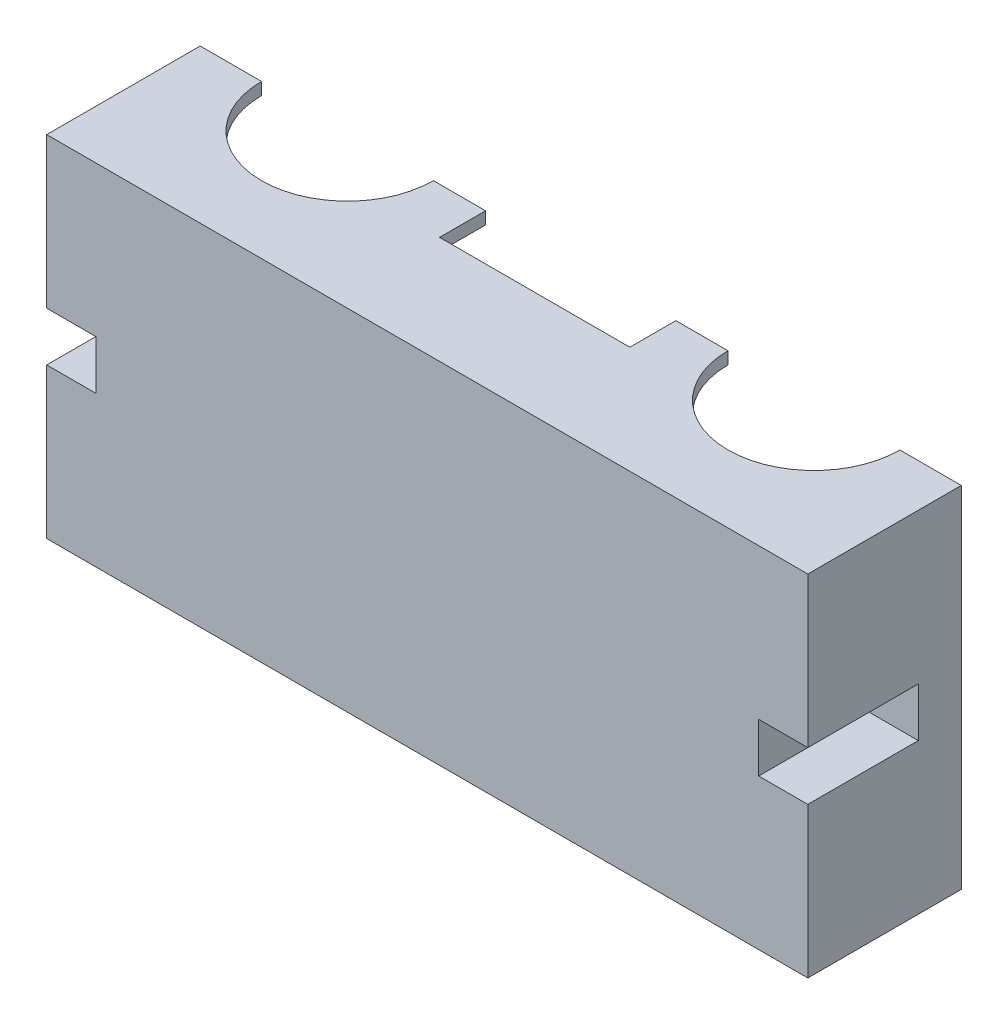
ISO-10303-21;
HEADER;
FILE_DESCRIPTION(('STEP AP214'),'2;1');
FILE_NAME('part.step','',(''),(''),'','','');
FILE_SCHEMA(('AUTOMOTIVE_DESIGN { 1 0 10303 214 1 1 1 1 }'));
ENDSEC;
DATA;
#1=APPLICATION_CONTEXT('core data for automotive mechanical design processes');
#2=APPLICATION_PROTOCOL_DEFINITION('international standard','automotive_design',2000,#1);
#3=PRODUCT_CONTEXT('',#1,'mechanical');
#4=PRODUCT('Part','Part','',(#3));
#5=PRODUCT_RELATED_PRODUCT_CATEGORY('part','',(#4));
#6=PRODUCT_DEFINITION_FORMATION('','',#4);
#7=PRODUCT_DEFINITION_CONTEXT('part definition',#1,'design');
#8=PRODUCT_DEFINITION('design','',#6,#7);
#9=PRODUCT_DEFINITION_SHAPE('','',#8);
#10=(LENGTH_UNIT() NAMED_UNIT(*) SI_UNIT(.MILLI.,.METRE.));
#11=(NAMED_UNIT(*) PLANE_ANGLE_UNIT() SI_UNIT($,.RADIAN.));
#12=(NAMED_UNIT(*) SI_UNIT($,.STERADIAN.) SOLID_ANGLE_UNIT());
#13=UNCERTAINTY_MEASURE_WITH_UNIT(LENGTH_MEASURE(1.E-05),#10,'distance_accuracy_value','');
#14=(GEOMETRIC_REPRESENTATION_CONTEXT(3) GLOBAL_UNCERTAINTY_ASSIGNED_CONTEXT((#13)) GLOBAL_UNIT_ASSIGNED_CONTEXT((#10,
#11,#12)) REPRESENTATION_CONTEXT('',''));
#15=CARTESIAN_POINT('',(0.,0.,0.));
#16=DIRECTION('',(0.,0.,1.));
#17=DIRECTION('',(1.,0.,0.));
#18=AXIS2_PLACEMENT_3D('',#15,#16,#17);
#19=CARTESIAN_POINT('',(0.,0.,0.));
#20=DIRECTION('',(0.,0.,-1.));
#21=DIRECTION('',(-1.,0.,0.));
#22=AXIS2_PLACEMENT_3D('',#19,#20,#21);
#23=PLANE('',#22);
#24=DIRECTION('',(0.,1.,0.));
#25=VECTOR('',#24,1.);
#26=CARTESIAN_POINT('',(-16.9591482885939,27.4147727272727,0.));
#27=LINE('',#26,#25);
#28=CARTESIAN_POINT('',(-16.9591482885939,27.4147727272727,0.));
#29=VERTEX_POINT('',#28);
#30=CARTESIAN_POINT('',(-16.9591482885939,29.4147727272727,0.));
#31=VERTEX_POINT('',#30);
#32=EDGE_CURVE('E262',#29,#31,#27,.T.);
#33=ORIENTED_EDGE('',*,*,#32,.F.);
#34=DIRECTION('',(-1.,0.,0.));
#35=VECTOR('',#34,1.);
#36=CARTESIAN_POINT('',(0.,27.4147727272727,0.));
#37=LINE('',#36,#35);
#38=CARTESIAN_POINT('',(-25.4591482885939,27.4147727272727,0.));
#39=VERTEX_POINT('',#38);
#40=EDGE_CURVE('E256',#29,#39,#37,.T.);
#41=ORIENTED_EDGE('',*,*,#40,.T.);
#42=DIRECTION('',(0.,1.,0.));
#43=VECTOR('',#42,1.);
#44=CARTESIAN_POINT('',(-25.4591482885939,27.4147727272727,0.));
#45=LINE('',#44,#43);
#46=CARTESIAN_POINT('',(-25.4591482885939,29.4147727272727,0.));
#47=VERTEX_POINT('',#46);
#48=EDGE_CURVE('E240',#39,#47,#45,.T.);
#49=ORIENTED_EDGE('',*,*,#48,.T.);
#50=DIRECTION('',(-1.,0.,0.));
#51=VECTOR('',#50,1.);
#52=CARTESIAN_POINT('',(-102.959148288594,29.4147727272727,0.));
#53=LINE('',#52,#51);
#54=EDGE_CURVE('E406',#31,#47,#53,.T.);
#55=ORIENTED_EDGE('',*,*,#54,.F.);
#56=EDGE_LOOP('',(#33,#41,#49,#55));
#57=FACE_BOUND('',#56,.T.);
#58=ADVANCED_FACE('F32',(#57),#23,.T.);
#59=DIRECTION('',(0.,1.,0.));
#60=VECTOR('',#59,1.);
#61=CARTESIAN_POINT('',(11.0408517114061,27.4147727272727,0.));
#62=LINE('',#61,#60);
#63=CARTESIAN_POINT('',(11.0408517114061,29.4147727272727,0.));
#64=VERTEX_POINT('',#63);
#65=CARTESIAN_POINT('',(11.0408517114061,27.4147727272727,0.));
#66=VERTEX_POINT('',#65);
#67=EDGE_CURVE('E430',#64,#66,#62,.F.);
#68=ORIENTED_EDGE('',*,*,#67,.F.);
#69=CARTESIAN_POINT('',(21.0408517114061,29.4147727272727,0.));
#70=VERTEX_POINT('',#69);
#71=EDGE_CURVE('E403',#70,#64,#53,.T.);
#72=ORIENTED_EDGE('',*,*,#71,.F.);
#73=DIRECTION('',(0.,1.,0.));
#74=VECTOR('',#73,1.);
#75=CARTESIAN_POINT('',(21.0408517114061,-27.5852272727273,0.));
#76=LINE('',#75,#74);
#77=CARTESIAN_POINT('',(21.0408517114061,-27.5852272727273,0.));
#78=VERTEX_POINT('',#77);
#79=EDGE_CURVE('E400',#78,#70,#76,.T.);
#80=ORIENTED_EDGE('',*,*,#79,.F.);
#81=DIRECTION('',(1.,0.,0.));
#82=VECTOR('',#81,1.);
#83=CARTESIAN_POINT('',(-102.959148288594,-27.5852272727273,0.));
#84=LINE('',#83,#82);
#85=CARTESIAN_POINT('',(-102.959148288594,-27.5852272727273,0.));
#86=VERTEX_POINT('',#85);
#87=EDGE_CURVE('E398',#86,#78,#84,.T.);
#88=ORIENTED_EDGE('',*,*,#87,.F.);
#89=DIRECTION('',(0.,-1.,0.));
#90=VECTOR('',#89,1.);
#91=CARTESIAN_POINT('',(-102.959148288594,-27.5852272727273,0.));
#92=LINE('',#91,#90);
#93=CARTESIAN_POINT('',(-102.959148288594,29.4147727272727,0.));
#94=VERTEX_POINT('',#93);
#95=EDGE_CURVE('E351',#94,#86,#92,.T.);
#96=ORIENTED_EDGE('',*,*,#95,.F.);
#97=CARTESIAN_POINT('',(-92.9591482885939,29.4147727272727,0.));
#98=VERTEX_POINT('',#97);
#99=EDGE_CURVE('E402',#98,#94,#53,.T.);
#100=ORIENTED_EDGE('',*,*,#99,.F.);
#101=DIRECTION('',(0.,1.,0.));
#102=VECTOR('',#101,1.);
#103=CARTESIAN_POINT('',(-92.9591482885939,27.4147727272727,0.));
#104=LINE('',#103,#102);
#105=CARTESIAN_POINT('',(-92.9591482885939,27.4147727272727,0.));
#106=VERTEX_POINT('',#105);
#107=EDGE_CURVE('E419',#106,#98,#104,.T.);
#108=ORIENTED_EDGE('',*,*,#107,.F.);
#109=CARTESIAN_POINT('',(-100.959148288594,27.4147727272727,0.));
#110=VERTEX_POINT('',#109);
#111=EDGE_CURVE('E268',#106,#110,#37,.T.);
#112=ORIENTED_EDGE('',*,*,#111,.T.);
#113=DIRECTION('',(0.,-1.,0.));
#114=VECTOR('',#113,1.);
#115=CARTESIAN_POINT('',(-100.959148288594,0.,0.));
#116=LINE('',#115,#114);
#117=CARTESIAN_POINT('',(-100.959148288594,7.41477272727273,0.));
#118=VERTEX_POINT('',#117);
#119=EDGE_CURVE('E272',#110,#118,#116,.T.);
#120=ORIENTED_EDGE('',*,*,#119,.T.);
#121=DIRECTION('',(-1.,0.,0.));
#122=VECTOR('',#121,1.);
#123=CARTESIAN_POINT('',(0.,7.41477272727273,0.));
#124=LINE('',#123,#122);
#125=CARTESIAN_POINT('',(-93.4591482885939,7.41477272727273,0.));
#126=VERTEX_POINT('',#125);
#127=EDGE_CURVE('E280',#126,#118,#124,.T.);
#128=ORIENTED_EDGE('',*,*,#127,.F.);
#129=DIRECTION('',(0.,-1.,0.));
#130=VECTOR('',#129,1.);
#131=CARTESIAN_POINT('',(-93.4591482885939,0.,0.));
#132=LINE('',#131,#130);
#133=CARTESIAN_POINT('',(-93.4591482885939,-5.58522727272727,0.));
#134=VERTEX_POINT('',#133);
#135=EDGE_CURVE('E296',#126,#134,#132,.T.);
#136=ORIENTED_EDGE('',*,*,#135,.T.);
#137=DIRECTION('',(-1.,0.,0.));
#138=VECTOR('',#137,1.);
#139=CARTESIAN_POINT('',(0.,-5.58522727272727,0.));
#140=LINE('',#139,#138);
#141=CARTESIAN_POINT('',(-100.959148288594,-5.58522727272727,0.));
#142=VERTEX_POINT('',#141);
#143=EDGE_CURVE('E287',#134,#142,#140,.T.);
#144=ORIENTED_EDGE('',*,*,#143,.T.);
#145=DIRECTION('',(0.,-1.,0.));
#146=VECTOR('',#145,1.);
#147=CARTESIAN_POINT('',(-100.959148288594,0.,0.));
#148=LINE('',#147,#146);
#149=CARTESIAN_POINT('',(-100.959148288594,-25.5852272727273,0.));
#150=VERTEX_POINT('',#149);
#151=EDGE_CURVE('E293',#142,#150,#148,.T.);
#152=ORIENTED_EDGE('',*,*,#151,.T.);
#153=DIRECTION('',(-1.,0.,0.));
#154=VECTOR('',#153,1.);
#155=CARTESIAN_POINT('',(0.,-25.5852272727273,0.));
#156=LINE('',#155,#154);
#157=CARTESIAN_POINT('',(19.0408517114061,-25.5852272727273,0.));
#158=VERTEX_POINT('',#157);
#159=EDGE_CURVE('E290',#158,#150,#156,.T.);
#160=ORIENTED_EDGE('',*,*,#159,.F.);
#161=DIRECTION('',(0.,-1.,0.));
#162=VECTOR('',#161,1.);
#163=CARTESIAN_POINT('',(19.0408517114061,0.,0.));
#164=LINE('',#163,#162);
#165=CARTESIAN_POINT('',(19.0408517114061,-5.58522727272727,0.));
#166=VERTEX_POINT('',#165);
#167=EDGE_CURVE('E286',#166,#158,#164,.T.);
#168=ORIENTED_EDGE('',*,*,#167,.F.);
#169=CARTESIAN_POINT('',(11.5408517114061,-5.58522727272727,0.));
#170=VERTEX_POINT('',#169);
#171=EDGE_CURVE('E283',#166,#170,#140,.T.);
#172=ORIENTED_EDGE('',*,*,#171,.T.);
#173=DIRECTION('',(0.,-1.,0.));
#174=VECTOR('',#173,1.);
#175=CARTESIAN_POINT('',(11.5408517114061,0.,0.));
#176=LINE('',#175,#174);
#177=CARTESIAN_POINT('',(11.5408517114061,7.41477272727273,0.));
#178=VERTEX_POINT('',#177);
#179=EDGE_CURVE('E279',#178,#170,#176,.T.);
#180=ORIENTED_EDGE('',*,*,#179,.F.);
#181=CARTESIAN_POINT('',(19.0408517114061,7.41477272727273,0.));
#182=VERTEX_POINT('',#181);
#183=EDGE_CURVE('E276',#182,#178,#124,.T.);
#184=ORIENTED_EDGE('',*,*,#183,.F.);
#185=DIRECTION('',(0.,-1.,0.));
#186=VECTOR('',#185,1.);
#187=CARTESIAN_POINT('',(19.0408517114061,0.,0.));
#188=LINE('',#187,#186);
#189=CARTESIAN_POINT('',(19.0408517114061,27.4147727272727,0.));
#190=VERTEX_POINT('',#189);
#191=EDGE_CURVE('E267',#190,#182,#188,.T.);
#192=ORIENTED_EDGE('',*,*,#191,.F.);
#193=EDGE_CURVE('E263',#190,#66,#37,.T.);
#194=ORIENTED_EDGE('',*,*,#193,.T.);
#195=EDGE_LOOP('',(#68,#72,#80,#88,#96,#100,#108,#112,#120,#128,#136,#144,#152,#160,#168,#172,
#180,#184,#192,#194));
#196=FACE_BOUND('',#195,.T.);
#197=ADVANCED_FACE('F426',(#196),#23,.T.);
#198=DIRECTION('',(0.,1.,0.));
#199=VECTOR('',#198,1.);
#200=CARTESIAN_POINT('',(-64.9591482885939,27.4147727272727,0.));
#201=LINE('',#200,#199);
#202=CARTESIAN_POINT('',(-64.9591482885939,29.4147727272727,0.));
#203=VERTEX_POINT('',#202);
#204=CARTESIAN_POINT('',(-64.9591482885939,27.4147727272727,0.));
#205=VERTEX_POINT('',#204);
#206=EDGE_CURVE('E55',#203,#205,#201,.F.);
#207=ORIENTED_EDGE('',*,*,#206,.F.);
#208=CARTESIAN_POINT('',(-56.4591482885939,29.4147727272727,0.));
#209=VERTEX_POINT('',#208);
#210=EDGE_CURVE('E547',#209,#203,#53,.T.);
#211=ORIENTED_EDGE('',*,*,#210,.F.);
#212=DIRECTION('',(0.,1.,0.));
#213=VECTOR('',#212,1.);
#214=CARTESIAN_POINT('',(-56.4591482885939,27.4147727272727,0.));
#215=LINE('',#214,#213);
#216=CARTESIAN_POINT('',(-56.4591482885939,27.4147727272727,0.));
#217=VERTEX_POINT('',#216);
#218=EDGE_CURVE('E250',#217,#209,#215,.T.);
#219=ORIENTED_EDGE('',*,*,#218,.F.);
#220=EDGE_CURVE('E264',#217,#205,#37,.T.);
#221=ORIENTED_EDGE('',*,*,#220,.T.);
#222=EDGE_LOOP('',(#207,#211,#219,#221));
#223=FACE_BOUND('',#222,.T.);
#224=ADVANCED_FACE('F548',(#223),#23,.T.);
#225=CARTESIAN_POINT('',(-102.959148288594,-27.5852272727273,25.));
#226=DIRECTION('',(1.,0.,0.));
#227=DIRECTION('',(0.,0.,-1.));
#228=AXIS2_PLACEMENT_3D('',#225,#226,#227);
#229=PLANE('',#228);
#230=DIRECTION('',(0.,-1.,0.));
#231=VECTOR('',#230,1.);
#232=CARTESIAN_POINT('',(-102.959148288594,-27.5852272727273,25.));
#233=LINE('',#232,#231);
#234=CARTESIAN_POINT('',(-102.959148288594,-3.08522727272727,25.));
#235=VERTEX_POINT('',#234);
#236=CARTESIAN_POINT('',(-102.959148288594,-27.5852272727273,25.));
#237=VERTEX_POINT('',#236);
#238=EDGE_CURVE('E387',#235,#237,#233,.T.);
#239=ORIENTED_EDGE('',*,*,#238,.F.);
#240=DIRECTION('',(0.,0.,1.));
#241=VECTOR('',#240,1.);
#242=CARTESIAN_POINT('',(-102.959148288594,-3.08522727272727,7.));
#243=LINE('',#242,#241);
#244=CARTESIAN_POINT('',(-102.959148288594,-3.08522727272727,7.));
#245=VERTEX_POINT('',#244);
#246=EDGE_CURVE('E376',#245,#235,#243,.T.);
#247=ORIENTED_EDGE('',*,*,#246,.F.);
#248=DIRECTION('',(0.,-1.,0.));
#249=VECTOR('',#248,1.);
#250=CARTESIAN_POINT('',(-102.959148288594,4.91477272727273,7.));
#251=LINE('',#250,#249);
#252=CARTESIAN_POINT('',(-102.959148288594,4.91477272727273,7.));
#253=VERTEX_POINT('',#252);
#254=EDGE_CURVE('E364',#253,#245,#251,.T.);
#255=ORIENTED_EDGE('',*,*,#254,.F.);
#256=DIRECTION('',(0.,0.,1.));
#257=VECTOR('',#256,1.);
#258=CARTESIAN_POINT('',(-102.959148288594,4.91477272727273,7.));
#259=LINE('',#258,#257);
#260=CARTESIAN_POINT('',(-102.959148288594,4.91477272727273,25.));
#261=VERTEX_POINT('',#260);
#262=EDGE_CURVE('E378',#253,#261,#259,.T.);
#263=ORIENTED_EDGE('',*,*,#262,.T.);
#264=CARTESIAN_POINT('',(-102.959148288594,29.4147727272727,25.));
#265=VERTEX_POINT('',#264);
#266=EDGE_CURVE('E383',#265,#261,#233,.T.);
#267=ORIENTED_EDGE('',*,*,#266,.F.);
#268=DIRECTION('',(0.,0.,-1.));
#269=VECTOR('',#268,1.);
#270=CARTESIAN_POINT('',(-102.959148288594,29.4147727272727,25.));
#271=LINE('',#270,#269);
#272=EDGE_CURVE('E395',#265,#94,#271,.T.);
#273=ORIENTED_EDGE('',*,*,#272,.T.);
#274=ORIENTED_EDGE('',*,*,#95,.T.);
#275=DIRECTION('',(0.,0.,-1.));
#276=VECTOR('',#275,1.);
#277=CARTESIAN_POINT('',(-102.959148288594,-27.5852272727273,25.));
#278=LINE('',#277,#276);
#279=EDGE_CURVE('E415',#237,#86,#278,.T.);
#280=ORIENTED_EDGE('',*,*,#279,.F.);
#281=EDGE_LOOP('',(#239,#247,#255,#263,#267,#273,#274,#280));
#282=FACE_BOUND('',#281,.T.);
#283=ADVANCED_FACE('F34',(#282),#229,.F.);
#284=CARTESIAN_POINT('',(-102.959148288594,-27.5852272727273,25.));
#285=DIRECTION('',(0.,1.,0.));
#286=DIRECTION('',(0.,0.,1.));
#287=AXIS2_PLACEMENT_3D('',#284,#285,#286);
#288=PLANE('',#287);
#289=ORIENTED_EDGE('',*,*,#87,.T.);
#290=DIRECTION('',(0.,0.,-1.));
#291=VECTOR('',#290,1.);
#292=CARTESIAN_POINT('',(21.0408517114061,-27.5852272727273,25.));
#293=LINE('',#292,#291);
#294=CARTESIAN_POINT('',(21.0408517114061,-27.5852272727273,25.));
#295=VERTEX_POINT('',#294);
#296=EDGE_CURVE('E412',#295,#78,#293,.T.);
#297=ORIENTED_EDGE('',*,*,#296,.F.);
#298=DIRECTION('',(1.,0.,0.));
#299=VECTOR('',#298,1.);
#300=CARTESIAN_POINT('',(-102.959148288594,-27.5852272727273,25.));
#301=LINE('',#300,#299);
#302=EDGE_CURVE('E386',#237,#295,#301,.T.);
#303=ORIENTED_EDGE('',*,*,#302,.F.);
#304=ORIENTED_EDGE('',*,*,#279,.T.);
#305=EDGE_LOOP('',(#289,#297,#303,#304));
#306=FACE_BOUND('',#305,.T.);
#307=ADVANCED_FACE('F559',(#306),#288,.F.);
#308=CARTESIAN_POINT('',(21.0408517114061,-27.5852272727273,25.));
#309=DIRECTION('',(-1.,0.,0.));
#310=DIRECTION('',(0.,-1.,0.));
#311=AXIS2_PLACEMENT_3D('',#308,#309,#310);
#312=PLANE('',#311);
#313=DIRECTION('',(0.,1.,0.));
#314=VECTOR('',#313,1.);
#315=CARTESIAN_POINT('',(21.0408517114061,4.91477272727273,7.));
#316=LINE('',#315,#314);
#317=CARTESIAN_POINT('',(21.0408517114061,-3.08522727272727,7.));
#318=VERTEX_POINT('',#317);
#319=CARTESIAN_POINT('',(21.0408517114061,4.91477272727273,7.));
#320=VERTEX_POINT('',#319);
#321=EDGE_CURVE('E326',#318,#320,#316,.T.);
#322=ORIENTED_EDGE('',*,*,#321,.F.);
#323=DIRECTION('',(0.,0.,1.));
#324=VECTOR('',#323,1.);
#325=CARTESIAN_POINT('',(21.0408517114061,-3.08522727272727,7.));
#326=LINE('',#325,#324);
#327=CARTESIAN_POINT('',(21.0408517114061,-3.08522727272727,25.));
#328=VERTEX_POINT('',#327);
#329=EDGE_CURVE('E348',#318,#328,#326,.T.);
#330=ORIENTED_EDGE('',*,*,#329,.T.);
#331=DIRECTION('',(0.,1.,0.));
#332=VECTOR('',#331,1.);
#333=CARTESIAN_POINT('',(21.0408517114061,-27.5852272727273,25.));
#334=LINE('',#333,#332);
#335=EDGE_CURVE('E390',#295,#328,#334,.T.);
#336=ORIENTED_EDGE('',*,*,#335,.F.);
#337=ORIENTED_EDGE('',*,*,#296,.T.);
#338=ORIENTED_EDGE('',*,*,#79,.T.);
#339=DIRECTION('',(0.,0.,-1.));
#340=VECTOR('',#339,1.);
#341=CARTESIAN_POINT('',(21.0408517114061,29.4147727272727,25.));
#342=LINE('',#341,#340);
#343=CARTESIAN_POINT('',(21.0408517114061,29.4147727272727,25.));
#344=VERTEX_POINT('',#343);
#345=EDGE_CURVE('E409',#344,#70,#342,.T.);
#346=ORIENTED_EDGE('',*,*,#345,.F.);
#347=CARTESIAN_POINT('',(21.0408517114061,4.91477272727272,25.));
#348=VERTEX_POINT('',#347);
#349=EDGE_CURVE('E389',#348,#344,#334,.T.);
#350=ORIENTED_EDGE('',*,*,#349,.F.);
#351=DIRECTION('',(0.,0.,1.));
#352=VECTOR('',#351,1.);
#353=CARTESIAN_POINT('',(21.0408517114061,4.91477272727273,7.));
#354=LINE('',#353,#352);
#355=EDGE_CURVE('E339',#320,#348,#354,.T.);
#356=ORIENTED_EDGE('',*,*,#355,.F.);
#357=EDGE_LOOP('',(#322,#330,#336,#337,#338,#346,#350,#356));
#358=FACE_BOUND('',#357,.T.);
#359=ADVANCED_FACE('F580',(#358),#312,.F.);
#360=CARTESIAN_POINT('',(-102.959148288594,29.4147727272727,25.));
#361=DIRECTION('',(0.,-1.,0.));
#362=DIRECTION('',(0.,0.,-1.));
#363=AXIS2_PLACEMENT_3D('',#360,#361,#362);
#364=PLANE('',#363);
#365=ORIENTED_EDGE('',*,*,#71,.T.);
#366=CARTESIAN_POINT('',(-2.95914828859391,29.4147727272727,0.));
#367=DIRECTION('',(0.,1.,0.));
#368=DIRECTION('',(0.,0.,1.));
#369=AXIS2_PLACEMENT_3D('',#366,#367,#368);
#370=CIRCLE('',#369,14.);
#371=EDGE_CURVE('E519',#31,#64,#370,.T.);
#372=ORIENTED_EDGE('',*,*,#371,.F.);
#373=ORIENTED_EDGE('',*,*,#54,.T.);
#374=DIRECTION('',(0.,0.,-1.));
#375=VECTOR('',#374,1.);
#376=CARTESIAN_POINT('',(-25.4591482885939,29.4147727272727,0.));
#377=LINE('',#376,#375);
#378=CARTESIAN_POINT('',(-25.4591482885939,29.4147727272727,7.5));
#379=VERTEX_POINT('',#378);
#380=EDGE_CURVE('E245',#379,#47,#377,.T.);
#381=ORIENTED_EDGE('',*,*,#380,.F.);
#382=DIRECTION('',(1.,0.,0.));
#383=VECTOR('',#382,1.);
#384=CARTESIAN_POINT('',(-25.4591482885939,29.4147727272727,7.5));
#385=LINE('',#384,#383);
#386=CARTESIAN_POINT('',(-56.4591482885939,29.4147727272727,7.5));
#387=VERTEX_POINT('',#386);
#388=EDGE_CURVE('E259',#387,#379,#385,.T.);
#389=ORIENTED_EDGE('',*,*,#388,.F.);
#390=DIRECTION('',(0.,0.,1.));
#391=VECTOR('',#390,1.);
#392=CARTESIAN_POINT('',(-56.4591482885939,29.4147727272727,0.));
#393=LINE('',#392,#391);
#394=EDGE_CURVE('E530',#209,#387,#393,.T.);
#395=ORIENTED_EDGE('',*,*,#394,.F.);
#396=ORIENTED_EDGE('',*,*,#210,.T.);
#397=CARTESIAN_POINT('',(-78.9591482885939,29.4147727272727,0.));
#398=DIRECTION('',(0.,1.,0.));
#399=DIRECTION('',(0.,0.,1.));
#400=AXIS2_PLACEMENT_3D('',#397,#398,#399);
#401=CIRCLE('',#400,14.);
#402=EDGE_CURVE('E521',#98,#203,#401,.T.);
#403=ORIENTED_EDGE('',*,*,#402,.F.);
#404=ORIENTED_EDGE('',*,*,#99,.T.);
#405=ORIENTED_EDGE('',*,*,#272,.F.);
#406=DIRECTION('',(-1.,0.,0.));
#407=VECTOR('',#406,1.);
#408=CARTESIAN_POINT('',(-102.959148288594,29.4147727272727,25.));
#409=LINE('',#408,#407);
#410=EDGE_CURVE('E393',#344,#265,#409,.T.);
#411=ORIENTED_EDGE('',*,*,#410,.F.);
#412=ORIENTED_EDGE('',*,*,#345,.T.);
#413=EDGE_LOOP('',(#365,#372,#373,#381,#389,#395,#396,#403,#404,#405,#411,#412));
#414=FACE_BOUND('',#413,.T.);
#415=ADVANCED_FACE('F546',(#414),#364,.F.);
#416=CARTESIAN_POINT('',(0.,0.,25.));
#417=DIRECTION('',(0.,0.,-1.));
#418=DIRECTION('',(-1.,0.,0.));
#419=AXIS2_PLACEMENT_3D('',#416,#417,#418);
#420=PLANE('',#419);
#421=ORIENTED_EDGE('',*,*,#335,.T.);
#422=DIRECTION('',(1.,0.,0.));
#423=VECTOR('',#422,1.);
#424=CARTESIAN_POINT('',(21.0408517114061,-3.08522727272727,25.));
#425=LINE('',#424,#423);
#426=CARTESIAN_POINT('',(13.0408517114061,-3.08522727272727,25.));
#427=VERTEX_POINT('',#426);
#428=EDGE_CURVE('E330',#427,#328,#425,.T.);
#429=ORIENTED_EDGE('',*,*,#428,.F.);
#430=DIRECTION('',(0.,-1.,0.));
#431=VECTOR('',#430,1.);
#432=CARTESIAN_POINT('',(13.0408517114061,4.91477272727273,25.));
#433=LINE('',#432,#431);
#434=CARTESIAN_POINT('',(13.0408517114061,4.91477272727273,25.));
#435=VERTEX_POINT('',#434);
#436=EDGE_CURVE('E343',#435,#427,#433,.T.);
#437=ORIENTED_EDGE('',*,*,#436,.F.);
#438=DIRECTION('',(-1.,0.,0.));
#439=VECTOR('',#438,1.);
#440=CARTESIAN_POINT('',(21.0408517114061,4.91477272727273,25.));
#441=LINE('',#440,#439);
#442=EDGE_CURVE('E340',#348,#435,#441,.T.);
#443=ORIENTED_EDGE('',*,*,#442,.F.);
#444=ORIENTED_EDGE('',*,*,#349,.T.);
#445=ORIENTED_EDGE('',*,*,#410,.T.);
#446=ORIENTED_EDGE('',*,*,#266,.T.);
#447=DIRECTION('',(-1.,0.,0.));
#448=VECTOR('',#447,1.);
#449=CARTESIAN_POINT('',(-94.9591482885939,4.91477272727273,25.));
#450=LINE('',#449,#448);
#451=CARTESIAN_POINT('',(-94.9591482885939,4.91477272727273,25.));
#452=VERTEX_POINT('',#451);
#453=EDGE_CURVE('E371',#452,#261,#450,.T.);
#454=ORIENTED_EDGE('',*,*,#453,.F.);
#455=DIRECTION('',(0.,1.,0.));
#456=VECTOR('',#455,1.);
#457=CARTESIAN_POINT('',(-94.9591482885939,4.91477272727273,25.));
#458=LINE('',#457,#456);
#459=CARTESIAN_POINT('',(-94.9591482885939,-3.08522727272727,25.));
#460=VERTEX_POINT('',#459);
#461=EDGE_CURVE('E301',#460,#452,#458,.T.);
#462=ORIENTED_EDGE('',*,*,#461,.F.);
#463=DIRECTION('',(1.,0.,0.));
#464=VECTOR('',#463,1.);
#465=CARTESIAN_POINT('',(-94.9591482885939,-3.08522727272727,25.));
#466=LINE('',#465,#464);
#467=EDGE_CURVE('E361',#235,#460,#466,.T.);
#468=ORIENTED_EDGE('',*,*,#467,.F.);
#469=ORIENTED_EDGE('',*,*,#238,.T.);
#470=ORIENTED_EDGE('',*,*,#302,.T.);
#471=EDGE_LOOP('',(#421,#429,#437,#443,#444,#445,#446,#454,#462,#468,#469,#470));
#472=FACE_BOUND('',#471,.T.);
#473=ADVANCED_FACE('F564',(#472),#420,.F.);
#474=CARTESIAN_POINT('',(-94.9591482885939,4.91477272727273,7.));
#475=DIRECTION('',(1.,0.,0.));
#476=DIRECTION('',(0.,0.,-1.));
#477=AXIS2_PLACEMENT_3D('',#474,#475,#476);
#478=PLANE('',#477);
#479=ORIENTED_EDGE('',*,*,#461,.T.);
#480=DIRECTION('',(0.,0.,1.));
#481=VECTOR('',#480,1.);
#482=CARTESIAN_POINT('',(-94.9591482885939,4.91477272727273,7.));
#483=LINE('',#482,#481);
#484=CARTESIAN_POINT('',(-94.9591482885939,4.91477272727273,7.));
#485=VERTEX_POINT('',#484);
#486=EDGE_CURVE('E369',#485,#452,#483,.T.);
#487=ORIENTED_EDGE('',*,*,#486,.F.);
#488=DIRECTION('',(0.,1.,0.));
#489=VECTOR('',#488,1.);
#490=CARTESIAN_POINT('',(-94.9591482885939,4.91477272727273,7.));
#491=LINE('',#490,#489);
#492=CARTESIAN_POINT('',(-94.9591482885939,-3.08522727272727,7.));
#493=VERTEX_POINT('',#492);
#494=EDGE_CURVE('E357',#493,#485,#491,.T.);
#495=ORIENTED_EDGE('',*,*,#494,.F.);
#496=DIRECTION('',(0.,0.,1.));
#497=VECTOR('',#496,1.);
#498=CARTESIAN_POINT('',(-94.9591482885939,-3.08522727272727,7.));
#499=LINE('',#498,#497);
#500=EDGE_CURVE('E344',#493,#460,#499,.T.);
#501=ORIENTED_EDGE('',*,*,#500,.T.);
#502=EDGE_LOOP('',(#479,#487,#495,#501));
#503=FACE_BOUND('',#502,.T.);
#504=ADVANCED_FACE('F626',(#503),#478,.F.);
#505=CARTESIAN_POINT('',(-94.9591482885939,-3.08522727272727,7.));
#506=DIRECTION('',(0.,-1.,0.));
#507=DIRECTION('',(1.,0.,0.));
#508=AXIS2_PLACEMENT_3D('',#505,#506,#507);
#509=PLANE('',#508);
#510=ORIENTED_EDGE('',*,*,#467,.T.);
#511=ORIENTED_EDGE('',*,*,#500,.F.);
#512=DIRECTION('',(1.,0.,0.));
#513=VECTOR('',#512,1.);
#514=CARTESIAN_POINT('',(-94.9591482885939,-3.08522727272727,7.));
#515=LINE('',#514,#513);
#516=EDGE_CURVE('E366',#245,#493,#515,.T.);
#517=ORIENTED_EDGE('',*,*,#516,.F.);
#518=ORIENTED_EDGE('',*,*,#246,.T.);
#519=EDGE_LOOP('',(#510,#511,#517,#518));
#520=FACE_BOUND('',#519,.T.);
#521=ADVANCED_FACE('F568',(#520),#509,.F.);
#522=CARTESIAN_POINT('',(-94.9591482885939,4.91477272727273,7.));
#523=DIRECTION('',(0.,1.,0.));
#524=DIRECTION('',(-1.,0.,0.));
#525=AXIS2_PLACEMENT_3D('',#522,#523,#524);
#526=PLANE('',#525);
#527=ORIENTED_EDGE('',*,*,#453,.T.);
#528=ORIENTED_EDGE('',*,*,#262,.F.);
#529=DIRECTION('',(-1.,0.,0.));
#530=VECTOR('',#529,1.);
#531=CARTESIAN_POINT('',(-94.9591482885939,4.91477272727273,7.));
#532=LINE('',#531,#530);
#533=EDGE_CURVE('E360',#485,#253,#532,.T.);
#534=ORIENTED_EDGE('',*,*,#533,.F.);
#535=ORIENTED_EDGE('',*,*,#486,.T.);
#536=EDGE_LOOP('',(#527,#528,#534,#535));
#537=FACE_BOUND('',#536,.T.);
#538=ADVANCED_FACE('F633',(#537),#526,.F.);
#539=CARTESIAN_POINT('',(0.,0.,7.));
#540=DIRECTION('',(0.,0.,-1.));
#541=DIRECTION('',(-1.,0.,0.));
#542=AXIS2_PLACEMENT_3D('',#539,#540,#541);
#543=PLANE('',#542);
#544=ORIENTED_EDGE('',*,*,#494,.T.);
#545=ORIENTED_EDGE('',*,*,#533,.T.);
#546=ORIENTED_EDGE('',*,*,#254,.T.);
#547=ORIENTED_EDGE('',*,*,#516,.T.);
#548=EDGE_LOOP('',(#544,#545,#546,#547));
#549=FACE_BOUND('',#548,.T.);
#550=ADVANCED_FACE('F572',(#549),#543,.F.);
#551=CARTESIAN_POINT('',(21.0408517114061,-3.08522727272727,7.));
#552=DIRECTION('',(0.,-1.,0.));
#553=DIRECTION('',(1.,0.,0.));
#554=AXIS2_PLACEMENT_3D('',#551,#552,#553);
#555=PLANE('',#554);
#556=ORIENTED_EDGE('',*,*,#428,.T.);
#557=ORIENTED_EDGE('',*,*,#329,.F.);
#558=DIRECTION('',(1.,0.,0.));
#559=VECTOR('',#558,1.);
#560=CARTESIAN_POINT('',(21.0408517114061,-3.08522727272727,7.));
#561=LINE('',#560,#559);
#562=CARTESIAN_POINT('',(13.0408517114061,-3.08522727272727,7.));
#563=VERTEX_POINT('',#562);
#564=EDGE_CURVE('E336',#563,#318,#561,.T.);
#565=ORIENTED_EDGE('',*,*,#564,.F.);
#566=DIRECTION('',(0.,0.,1.));
#567=VECTOR('',#566,1.);
#568=CARTESIAN_POINT('',(13.0408517114061,-3.08522727272727,7.));
#569=LINE('',#568,#567);
#570=EDGE_CURVE('E352',#563,#427,#569,.T.);
#571=ORIENTED_EDGE('',*,*,#570,.T.);
#572=EDGE_LOOP('',(#556,#557,#565,#571));
#573=FACE_BOUND('',#572,.T.);
#574=ADVANCED_FACE('F586',(#573),#555,.F.);
#575=CARTESIAN_POINT('',(13.0408517114061,4.91477272727273,7.));
#576=DIRECTION('',(-1.,0.,0.));
#577=DIRECTION('',(0.,-1.,0.));
#578=AXIS2_PLACEMENT_3D('',#575,#576,#577);
#579=PLANE('',#578);
#580=ORIENTED_EDGE('',*,*,#436,.T.);
#581=ORIENTED_EDGE('',*,*,#570,.F.);
#582=DIRECTION('',(0.,-1.,0.));
#583=VECTOR('',#582,1.);
#584=CARTESIAN_POINT('',(13.0408517114061,4.91477272727273,7.));
#585=LINE('',#584,#583);
#586=CARTESIAN_POINT('',(13.0408517114061,4.91477272727273,7.));
#587=VERTEX_POINT('',#586);
#588=EDGE_CURVE('E333',#587,#563,#585,.T.);
#589=ORIENTED_EDGE('',*,*,#588,.F.);
#590=DIRECTION('',(0.,0.,1.));
#591=VECTOR('',#590,1.);
#592=CARTESIAN_POINT('',(13.0408517114061,4.91477272727273,7.));
#593=LINE('',#592,#591);
#594=EDGE_CURVE('E354',#587,#435,#593,.T.);
#595=ORIENTED_EDGE('',*,*,#594,.T.);
#596=EDGE_LOOP('',(#580,#581,#589,#595));
#597=FACE_BOUND('',#596,.T.);
#598=ADVANCED_FACE('F590',(#597),#579,.F.);
#599=CARTESIAN_POINT('',(21.0408517114061,4.91477272727273,7.));
#600=DIRECTION('',(0.,1.,0.));
#601=DIRECTION('',(-1.,0.,0.));
#602=AXIS2_PLACEMENT_3D('',#599,#600,#601);
#603=PLANE('',#602);
#604=ORIENTED_EDGE('',*,*,#442,.T.);
#605=ORIENTED_EDGE('',*,*,#594,.F.);
#606=DIRECTION('',(-1.,0.,0.));
#607=VECTOR('',#606,1.);
#608=CARTESIAN_POINT('',(21.0408517114061,4.91477272727273,7.));
#609=LINE('',#608,#607);
#610=EDGE_CURVE('E329',#320,#587,#609,.T.);
#611=ORIENTED_EDGE('',*,*,#610,.F.);
#612=ORIENTED_EDGE('',*,*,#355,.T.);
#613=EDGE_LOOP('',(#604,#605,#611,#612));
#614=FACE_BOUND('',#613,.T.);
#615=ADVANCED_FACE('F592',(#614),#603,.F.);
#616=CARTESIAN_POINT('',(0.,0.,7.));
#617=DIRECTION('',(0.,0.,-1.));
#618=DIRECTION('',(-1.,0.,0.));
#619=AXIS2_PLACEMENT_3D('',#616,#617,#618);
#620=PLANE('',#619);
#621=ORIENTED_EDGE('',*,*,#321,.T.);
#622=ORIENTED_EDGE('',*,*,#610,.T.);
#623=ORIENTED_EDGE('',*,*,#588,.T.);
#624=ORIENTED_EDGE('',*,*,#564,.T.);
#625=EDGE_LOOP('',(#621,#622,#623,#624));
#626=FACE_BOUND('',#625,.T.);
#627=ADVANCED_FACE('F594',(#626),#620,.F.);
#628=CARTESIAN_POINT('',(-100.959148288594,0.,23.));
#629=DIRECTION('',(1.,0.,0.));
#630=DIRECTION('',(0.,0.,-1.));
#631=AXIS2_PLACEMENT_3D('',#628,#629,#630);
#632=PLANE('',#631);
#633=ORIENTED_EDGE('',*,*,#119,.F.);
#634=DIRECTION('',(0.,0.,-1.));
#635=VECTOR('',#634,1.);
#636=CARTESIAN_POINT('',(-100.959148288594,27.4147727272727,23.));
#637=LINE('',#636,#635);
#638=CARTESIAN_POINT('',(-100.959148288594,27.4147727272727,23.));
#639=VERTEX_POINT('',#638);
#640=EDGE_CURVE('E322',#639,#110,#637,.T.);
#641=ORIENTED_EDGE('',*,*,#640,.F.);
#642=DIRECTION('',(0.,-1.,0.));
#643=VECTOR('',#642,1.);
#644=CARTESIAN_POINT('',(-100.959148288594,0.,23.));
#645=LINE('',#644,#643);
#646=CARTESIAN_POINT('',(-100.959148288594,7.41477272727273,23.));
#647=VERTEX_POINT('',#646);
#648=EDGE_CURVE('E439',#639,#647,#645,.T.);
#649=ORIENTED_EDGE('',*,*,#648,.T.);
#650=DIRECTION('',(0.,0.,-1.));
#651=VECTOR('',#650,1.);
#652=CARTESIAN_POINT('',(-100.959148288594,7.41477272727273,23.));
#653=LINE('',#652,#651);
#654=EDGE_CURVE('E299',#647,#118,#653,.T.);
#655=ORIENTED_EDGE('',*,*,#654,.T.);
#656=EDGE_LOOP('',(#633,#641,#649,#655));
#657=FACE_BOUND('',#656,.T.);
#658=ADVANCED_FACE('F496',(#657),#632,.T.);
#659=CARTESIAN_POINT('',(0.,7.41477272727273,23.));
#660=DIRECTION('',(0.,-1.,0.));
#661=DIRECTION('',(0.,0.,-1.));
#662=AXIS2_PLACEMENT_3D('',#659,#660,#661);
#663=PLANE('',#662);
#664=ORIENTED_EDGE('',*,*,#127,.T.);
#665=ORIENTED_EDGE('',*,*,#654,.F.);
#666=DIRECTION('',(-1.,0.,0.));
#667=VECTOR('',#666,1.);
#668=CARTESIAN_POINT('',(0.,7.41477272727273,23.));
#669=LINE('',#668,#667);
#670=CARTESIAN_POINT('',(-93.4591482885939,7.41477272727273,23.));
#671=VERTEX_POINT('',#670);
#672=EDGE_CURVE('E325',#671,#647,#669,.T.);
#673=ORIENTED_EDGE('',*,*,#672,.F.);
#674=DIRECTION('',(0.,0.,-1.));
#675=VECTOR('',#674,1.);
#676=CARTESIAN_POINT('',(-93.4591482885939,7.41477272727273,23.));
#677=LINE('',#676,#675);
#678=EDGE_CURVE('E302',#671,#126,#677,.T.);
#679=ORIENTED_EDGE('',*,*,#678,.T.);
#680=EDGE_LOOP('',(#664,#665,#673,#679));
#681=FACE_BOUND('',#680,.T.);
#682=ADVANCED_FACE('F494',(#681),#663,.F.);
#683=CARTESIAN_POINT('',(-93.4591482885939,0.,23.));
#684=DIRECTION('',(1.,0.,0.));
#685=DIRECTION('',(0.,0.,-1.));
#686=AXIS2_PLACEMENT_3D('',#683,#684,#685);
#687=PLANE('',#686);
#688=ORIENTED_EDGE('',*,*,#135,.F.);
#689=ORIENTED_EDGE('',*,*,#678,.F.);
#690=DIRECTION('',(0.,-1.,0.));
#691=VECTOR('',#690,1.);
#692=CARTESIAN_POINT('',(-93.4591482885939,0.,23.));
#693=LINE('',#692,#691);
#694=CARTESIAN_POINT('',(-93.4591482885939,-5.58522727272727,23.));
#695=VERTEX_POINT('',#694);
#696=EDGE_CURVE('E462',#671,#695,#693,.T.);
#697=ORIENTED_EDGE('',*,*,#696,.T.);
#698=DIRECTION('',(0.,0.,-1.));
#699=VECTOR('',#698,1.);
#700=CARTESIAN_POINT('',(-93.4591482885939,-5.58522727272727,23.));
#701=LINE('',#700,#699);
#702=EDGE_CURVE('E304',#695,#134,#701,.T.);
#703=ORIENTED_EDGE('',*,*,#702,.T.);
#704=EDGE_LOOP('',(#688,#689,#697,#703));
#705=FACE_BOUND('',#704,.T.);
#706=ADVANCED_FACE('F490',(#705),#687,.T.);
#707=CARTESIAN_POINT('',(0.,-5.58522727272727,23.));
#708=DIRECTION('',(0.,-1.,0.));
#709=DIRECTION('',(0.,0.,-1.));
#710=AXIS2_PLACEMENT_3D('',#707,#708,#709);
#711=PLANE('',#710);
#712=ORIENTED_EDGE('',*,*,#143,.F.);
#713=ORIENTED_EDGE('',*,*,#702,.F.);
#714=DIRECTION('',(-1.,0.,0.));
#715=VECTOR('',#714,1.);
#716=CARTESIAN_POINT('',(0.,-5.58522727272727,23.));
#717=LINE('',#716,#715);
#718=CARTESIAN_POINT('',(-100.959148288594,-5.58522727272727,23.));
#719=VERTEX_POINT('',#718);
#720=EDGE_CURVE('E455',#695,#719,#717,.T.);
#721=ORIENTED_EDGE('',*,*,#720,.T.);
#722=DIRECTION('',(0.,0.,-1.));
#723=VECTOR('',#722,1.);
#724=CARTESIAN_POINT('',(-100.959148288594,-5.58522727272727,23.));
#725=LINE('',#724,#723);
#726=EDGE_CURVE('E306',#719,#142,#725,.T.);
#727=ORIENTED_EDGE('',*,*,#726,.T.);
#728=EDGE_LOOP('',(#712,#713,#721,#727));
#729=FACE_BOUND('',#728,.T.);
#730=ADVANCED_FACE('F471',(#729),#711,.T.);
#731=CARTESIAN_POINT('',(-100.959148288594,0.,23.));
#732=DIRECTION('',(1.,0.,0.));
#733=DIRECTION('',(0.,0.,-1.));
#734=AXIS2_PLACEMENT_3D('',#731,#732,#733);
#735=PLANE('',#734);
#736=ORIENTED_EDGE('',*,*,#151,.F.);
#737=ORIENTED_EDGE('',*,*,#726,.F.);
#738=DIRECTION('',(0.,-1.,0.));
#739=VECTOR('',#738,1.);
#740=CARTESIAN_POINT('',(-100.959148288594,0.,23.));
#741=LINE('',#740,#739);
#742=CARTESIAN_POINT('',(-100.959148288594,-25.5852272727273,23.));
#743=VERTEX_POINT('',#742);
#744=EDGE_CURVE('E461',#719,#743,#741,.T.);
#745=ORIENTED_EDGE('',*,*,#744,.T.);
#746=DIRECTION('',(0.,0.,-1.));
#747=VECTOR('',#746,1.);
#748=CARTESIAN_POINT('',(-100.959148288594,-25.5852272727273,23.));
#749=LINE('',#748,#747);
#750=EDGE_CURVE('E308',#743,#150,#749,.T.);
#751=ORIENTED_EDGE('',*,*,#750,.T.);
#752=EDGE_LOOP('',(#736,#737,#745,#751));
#753=FACE_BOUND('',#752,.T.);
#754=ADVANCED_FACE('F476',(#753),#735,.T.);
#755=CARTESIAN_POINT('',(0.,-25.5852272727273,23.));
#756=DIRECTION('',(0.,-1.,0.));
#757=DIRECTION('',(0.,0.,-1.));
#758=AXIS2_PLACEMENT_3D('',#755,#756,#757);
#759=PLANE('',#758);
#760=ORIENTED_EDGE('',*,*,#159,.T.);
#761=ORIENTED_EDGE('',*,*,#750,.F.);
#762=DIRECTION('',(-1.,0.,0.));
#763=VECTOR('',#762,1.);
#764=CARTESIAN_POINT('',(0.,-25.5852272727273,23.));
#765=LINE('',#764,#763);
#766=CARTESIAN_POINT('',(19.0408517114061,-25.5852272727273,23.));
#767=VERTEX_POINT('',#766);
#768=EDGE_CURVE('E458',#767,#743,#765,.T.);
#769=ORIENTED_EDGE('',*,*,#768,.F.);
#770=DIRECTION('',(0.,0.,-1.));
#771=VECTOR('',#770,1.);
#772=CARTESIAN_POINT('',(19.0408517114061,-25.5852272727273,23.));
#773=LINE('',#772,#771);
#774=EDGE_CURVE('E310',#767,#158,#773,.T.);
#775=ORIENTED_EDGE('',*,*,#774,.T.);
#776=EDGE_LOOP('',(#760,#761,#769,#775));
#777=FACE_BOUND('',#776,.T.);
#778=ADVANCED_FACE('F485',(#777),#759,.F.);
#779=CARTESIAN_POINT('',(19.0408517114061,0.,23.));
#780=DIRECTION('',(1.,0.,0.));
#781=DIRECTION('',(0.,1.,0.));
#782=AXIS2_PLACEMENT_3D('',#779,#780,#781);
#783=PLANE('',#782);
#784=ORIENTED_EDGE('',*,*,#167,.T.);
#785=ORIENTED_EDGE('',*,*,#774,.F.);
#786=DIRECTION('',(0.,-1.,0.));
#787=VECTOR('',#786,1.);
#788=CARTESIAN_POINT('',(19.0408517114061,0.,23.));
#789=LINE('',#788,#787);
#790=CARTESIAN_POINT('',(19.0408517114061,-5.58522727272727,23.));
#791=VERTEX_POINT('',#790);
#792=EDGE_CURVE('E454',#791,#767,#789,.T.);
#793=ORIENTED_EDGE('',*,*,#792,.F.);
#794=DIRECTION('',(0.,0.,-1.));
#795=VECTOR('',#794,1.);
#796=CARTESIAN_POINT('',(19.0408517114061,-5.58522727272727,23.));
#797=LINE('',#796,#795);
#798=EDGE_CURVE('E312',#791,#166,#797,.T.);
#799=ORIENTED_EDGE('',*,*,#798,.T.);
#800=EDGE_LOOP('',(#784,#785,#793,#799));
#801=FACE_BOUND('',#800,.T.);
#802=ADVANCED_FACE('F516',(#801),#783,.F.);
#803=ORIENTED_EDGE('',*,*,#171,.F.);
#804=ORIENTED_EDGE('',*,*,#798,.F.);
#805=CARTESIAN_POINT('',(11.5408517114061,-5.58522727272727,23.));
#806=VERTEX_POINT('',#805);
#807=EDGE_CURVE('E452',#791,#806,#717,.T.);
#808=ORIENTED_EDGE('',*,*,#807,.T.);
#809=DIRECTION('',(0.,0.,-1.));
#810=VECTOR('',#809,1.);
#811=CARTESIAN_POINT('',(11.5408517114061,-5.58522727272727,23.));
#812=LINE('',#811,#810);
#813=EDGE_CURVE('E314',#806,#170,#812,.T.);
#814=ORIENTED_EDGE('',*,*,#813,.T.);
#815=EDGE_LOOP('',(#803,#804,#808,#814));
#816=FACE_BOUND('',#815,.T.);
#817=ADVANCED_FACE('F514',(#816),#711,.T.);
#818=CARTESIAN_POINT('',(11.5408517114061,0.,23.));
#819=DIRECTION('',(1.,0.,0.));
#820=DIRECTION('',(0.,1.,0.));
#821=AXIS2_PLACEMENT_3D('',#818,#819,#820);
#822=PLANE('',#821);
#823=ORIENTED_EDGE('',*,*,#179,.T.);
#824=ORIENTED_EDGE('',*,*,#813,.F.);
#825=DIRECTION('',(0.,-1.,0.));
#826=VECTOR('',#825,1.);
#827=CARTESIAN_POINT('',(11.5408517114061,0.,23.));
#828=LINE('',#827,#826);
#829=CARTESIAN_POINT('',(11.5408517114061,7.41477272727273,23.));
#830=VERTEX_POINT('',#829);
#831=EDGE_CURVE('E449',#830,#806,#828,.T.);
#832=ORIENTED_EDGE('',*,*,#831,.F.);
#833=DIRECTION('',(0.,0.,-1.));
#834=VECTOR('',#833,1.);
#835=CARTESIAN_POINT('',(11.5408517114061,7.41477272727273,23.));
#836=LINE('',#835,#834);
#837=EDGE_CURVE('E316',#830,#178,#836,.T.);
#838=ORIENTED_EDGE('',*,*,#837,.T.);
#839=EDGE_LOOP('',(#823,#824,#832,#838));
#840=FACE_BOUND('',#839,.T.);
#841=ADVANCED_FACE('F510',(#840),#822,.F.);
#842=ORIENTED_EDGE('',*,*,#183,.T.);
#843=ORIENTED_EDGE('',*,*,#837,.F.);
#844=CARTESIAN_POINT('',(19.0408517114061,7.41477272727273,23.));
#845=VERTEX_POINT('',#844);
#846=EDGE_CURVE('E446',#845,#830,#669,.T.);
#847=ORIENTED_EDGE('',*,*,#846,.F.);
#848=DIRECTION('',(0.,0.,-1.));
#849=VECTOR('',#848,1.);
#850=CARTESIAN_POINT('',(19.0408517114061,7.41477272727273,23.));
#851=LINE('',#850,#849);
#852=EDGE_CURVE('E318',#845,#182,#851,.T.);
#853=ORIENTED_EDGE('',*,*,#852,.T.);
#854=EDGE_LOOP('',(#842,#843,#847,#853));
#855=FACE_BOUND('',#854,.T.);
#856=ADVANCED_FACE('F506',(#855),#663,.F.);
#857=CARTESIAN_POINT('',(19.0408517114061,0.,23.));
#858=DIRECTION('',(1.,0.,0.));
#859=DIRECTION('',(0.,1.,0.));
#860=AXIS2_PLACEMENT_3D('',#857,#858,#859);
#861=PLANE('',#860);
#862=ORIENTED_EDGE('',*,*,#191,.T.);
#863=ORIENTED_EDGE('',*,*,#852,.F.);
#864=DIRECTION('',(0.,-1.,0.));
#865=VECTOR('',#864,1.);
#866=CARTESIAN_POINT('',(19.0408517114061,0.,23.));
#867=LINE('',#866,#865);
#868=CARTESIAN_POINT('',(19.0408517114061,27.4147727272727,23.));
#869=VERTEX_POINT('',#868);
#870=EDGE_CURVE('E443',#869,#845,#867,.T.);
#871=ORIENTED_EDGE('',*,*,#870,.F.);
#872=DIRECTION('',(0.,0.,-1.));
#873=VECTOR('',#872,1.);
#874=CARTESIAN_POINT('',(19.0408517114061,27.4147727272727,23.));
#875=LINE('',#874,#873);
#876=EDGE_CURVE('E320',#869,#190,#875,.T.);
#877=ORIENTED_EDGE('',*,*,#876,.T.);
#878=EDGE_LOOP('',(#862,#863,#871,#877));
#879=FACE_BOUND('',#878,.T.);
#880=ADVANCED_FACE('F500',(#879),#861,.F.);
#881=CARTESIAN_POINT('',(0.,27.4147727272727,23.));
#882=DIRECTION('',(0.,-1.,0.));
#883=DIRECTION('',(0.,0.,-1.));
#884=AXIS2_PLACEMENT_3D('',#881,#882,#883);
#885=PLANE('',#884);
#886=CARTESIAN_POINT('',(-2.95914828859391,27.4147727272727,0.));
#887=DIRECTION('',(0.,-1.,0.));
#888=DIRECTION('',(0.,0.,-1.));
#889=AXIS2_PLACEMENT_3D('',#886,#887,#888);
#890=CIRCLE('',#889,14.);
#891=EDGE_CURVE('E11',#66,#29,#890,.T.);
#892=ORIENTED_EDGE('',*,*,#891,.F.);
#893=ORIENTED_EDGE('',*,*,#193,.F.);
#894=ORIENTED_EDGE('',*,*,#876,.F.);
#895=DIRECTION('',(-1.,0.,0.));
#896=VECTOR('',#895,1.);
#897=CARTESIAN_POINT('',(0.,27.4147727272727,23.));
#898=LINE('',#897,#896);
#899=EDGE_CURVE('E441',#869,#639,#898,.T.);
#900=ORIENTED_EDGE('',*,*,#899,.T.);
#901=ORIENTED_EDGE('',*,*,#640,.T.);
#902=ORIENTED_EDGE('',*,*,#111,.F.);
#903=CARTESIAN_POINT('',(-78.9591482885939,27.4147727272727,0.));
#904=DIRECTION('',(0.,-1.,0.));
#905=DIRECTION('',(0.,0.,-1.));
#906=AXIS2_PLACEMENT_3D('',#903,#904,#905);
#907=CIRCLE('',#906,14.);
#908=EDGE_CURVE('E40',#205,#106,#907,.T.);
#909=ORIENTED_EDGE('',*,*,#908,.F.);
#910=ORIENTED_EDGE('',*,*,#220,.F.);
#911=DIRECTION('',(0.,0.,1.));
#912=VECTOR('',#911,1.);
#913=CARTESIAN_POINT('',(-56.4591482885939,27.4147727272727,0.));
#914=LINE('',#913,#912);
#915=CARTESIAN_POINT('',(-56.4591482885939,27.4147727272727,7.5));
#916=VERTEX_POINT('',#915);
#917=EDGE_CURVE('E258',#217,#916,#914,.T.);
#918=ORIENTED_EDGE('',*,*,#917,.T.);
#919=DIRECTION('',(1.,0.,0.));
#920=VECTOR('',#919,1.);
#921=CARTESIAN_POINT('',(-25.4591482885939,27.4147727272727,7.5));
#922=LINE('',#921,#920);
#923=CARTESIAN_POINT('',(-25.4591482885939,27.4147727272727,7.5));
#924=VERTEX_POINT('',#923);
#925=EDGE_CURVE('E47',#916,#924,#922,.T.);
#926=ORIENTED_EDGE('',*,*,#925,.T.);
#927=DIRECTION('',(0.,0.,-1.));
#928=VECTOR('',#927,1.);
#929=CARTESIAN_POINT('',(-25.4591482885939,27.4147727272727,0.));
#930=LINE('',#929,#928);
#931=EDGE_CURVE('E243',#924,#39,#930,.T.);
#932=ORIENTED_EDGE('',*,*,#931,.T.);
#933=ORIENTED_EDGE('',*,*,#40,.F.);
#934=EDGE_LOOP('',(#892,#893,#894,#900,#901,#902,#909,#910,#918,#926,#932,#933));
#935=FACE_BOUND('',#934,.T.);
#936=ADVANCED_FACE('F255',(#935),#885,.T.);
#937=CARTESIAN_POINT('',(0.,0.,23.));
#938=DIRECTION('',(0.,0.,-1.));
#939=DIRECTION('',(-1.,0.,0.));
#940=AXIS2_PLACEMENT_3D('',#937,#938,#939);
#941=PLANE('',#940);
#942=ORIENTED_EDGE('',*,*,#648,.F.);
#943=ORIENTED_EDGE('',*,*,#899,.F.);
#944=ORIENTED_EDGE('',*,*,#870,.T.);
#945=ORIENTED_EDGE('',*,*,#846,.T.);
#946=ORIENTED_EDGE('',*,*,#831,.T.);
#947=ORIENTED_EDGE('',*,*,#807,.F.);
#948=ORIENTED_EDGE('',*,*,#792,.T.);
#949=ORIENTED_EDGE('',*,*,#768,.T.);
#950=ORIENTED_EDGE('',*,*,#744,.F.);
#951=ORIENTED_EDGE('',*,*,#720,.F.);
#952=ORIENTED_EDGE('',*,*,#696,.F.);
#953=ORIENTED_EDGE('',*,*,#672,.T.);
#954=EDGE_LOOP('',(#942,#943,#944,#945,#946,#947,#948,#949,#950,#951,#952,#953));
#955=FACE_BOUND('',#954,.T.);
#956=ADVANCED_FACE('F480',(#955),#941,.T.);
#957=CARTESIAN_POINT('',(-25.4591482885939,27.4147727272727,0.));
#958=DIRECTION('',(1.,0.,0.));
#959=DIRECTION('',(0.,0.,-1.));
#960=AXIS2_PLACEMENT_3D('',#957,#958,#959);
#961=PLANE('',#960);
#962=ORIENTED_EDGE('',*,*,#380,.T.);
#963=ORIENTED_EDGE('',*,*,#48,.F.);
#964=ORIENTED_EDGE('',*,*,#931,.F.);
#965=DIRECTION('',(0.,1.,0.));
#966=VECTOR('',#965,1.);
#967=CARTESIAN_POINT('',(-25.4591482885939,27.4147727272727,7.5));
#968=LINE('',#967,#966);
#969=EDGE_CURVE('E524',#924,#379,#968,.T.);
#970=ORIENTED_EDGE('',*,*,#969,.T.);
#971=EDGE_LOOP('',(#962,#963,#964,#970));
#972=FACE_BOUND('',#971,.T.);
#973=ADVANCED_FACE('F242',(#972),#961,.F.);
#974=CARTESIAN_POINT('',(-25.4591482885939,27.4147727272727,7.5));
#975=DIRECTION('',(0.,0.,1.));
#976=DIRECTION('',(1.,0.,0.));
#977=AXIS2_PLACEMENT_3D('',#974,#975,#976);
#978=PLANE('',#977);
#979=ORIENTED_EDGE('',*,*,#388,.T.);
#980=ORIENTED_EDGE('',*,*,#969,.F.);
#981=ORIENTED_EDGE('',*,*,#925,.F.);
#982=DIRECTION('',(0.,1.,0.));
#983=VECTOR('',#982,1.);
#984=CARTESIAN_POINT('',(-56.4591482885939,27.4147727272727,7.5));
#985=LINE('',#984,#983);
#986=EDGE_CURVE('E536',#916,#387,#985,.T.);
#987=ORIENTED_EDGE('',*,*,#986,.T.);
#988=EDGE_LOOP('',(#979,#980,#981,#987));
#989=FACE_BOUND('',#988,.T.);
#990=ADVANCED_FACE('F793',(#989),#978,.F.);
#991=CARTESIAN_POINT('',(-56.4591482885939,27.4147727272727,0.));
#992=DIRECTION('',(-1.,0.,0.));
#993=DIRECTION('',(0.,0.,1.));
#994=AXIS2_PLACEMENT_3D('',#991,#992,#993);
#995=PLANE('',#994);
#996=ORIENTED_EDGE('',*,*,#394,.T.);
#997=ORIENTED_EDGE('',*,*,#986,.F.);
#998=ORIENTED_EDGE('',*,*,#917,.F.);
#999=ORIENTED_EDGE('',*,*,#218,.T.);
#1000=EDGE_LOOP('',(#996,#997,#998,#999));
#1001=FACE_BOUND('',#1000,.T.);
#1002=ADVANCED_FACE('F541',(#1001),#995,.F.);
#1003=CARTESIAN_POINT('',(-78.9591482885939,27.4147727272727,0.));
#1004=DIRECTION('',(0.,1.,0.));
#1005=DIRECTION('',(0.,0.,1.));
#1006=AXIS2_PLACEMENT_3D('',#1003,#1004,#1005);
#1007=CYLINDRICAL_SURFACE('',#1006,14.);
#1008=ORIENTED_EDGE('',*,*,#107,.T.);
#1009=ORIENTED_EDGE('',*,*,#402,.T.);
#1010=ORIENTED_EDGE('',*,*,#206,.T.);
#1011=ORIENTED_EDGE('',*,*,#908,.T.);
#1012=EDGE_LOOP('',(#1008,#1009,#1010,#1011));
#1013=FACE_BOUND('',#1012,.T.);
#1014=ADVANCED_FACE('F418',(#1013),#1007,.F.);
#1015=CARTESIAN_POINT('',(-2.95914828859391,27.4147727272727,0.));
#1016=DIRECTION('',(0.,1.,0.));
#1017=DIRECTION('',(0.,0.,1.));
#1018=AXIS2_PLACEMENT_3D('',#1015,#1016,#1017);
#1019=CYLINDRICAL_SURFACE('',#1018,14.);
#1020=ORIENTED_EDGE('',*,*,#32,.T.);
#1021=ORIENTED_EDGE('',*,*,#371,.T.);
#1022=ORIENTED_EDGE('',*,*,#67,.T.);
#1023=ORIENTED_EDGE('',*,*,#891,.T.);
#1024=EDGE_LOOP('',(#1020,#1021,#1022,#1023));
#1025=FACE_BOUND('',#1024,.T.);
#1026=ADVANCED_FACE('F518',(#1025),#1019,.F.);
#1027=CLOSED_SHELL('',(#58,#197,#224,#283,#307,#359,#415,#473,#504,#521,#538,#550,#574,#598,
#615,#627,#658,#682,#706,#730,#754,#778,#802,#817,#841,#856,#880,#936,#956,#973,#990,#1002,
#1014,#1026));
#1028=MANIFOLD_SOLID_BREP('B2',#1027);
#1029=ADVANCED_BREP_SHAPE_REPRESENTATION('',(#18,#1028),#14);
#1030=SHAPE_DEFINITION_REPRESENTATION(#9,#1029);
ENDSEC;
END-ISO-10303-21;
